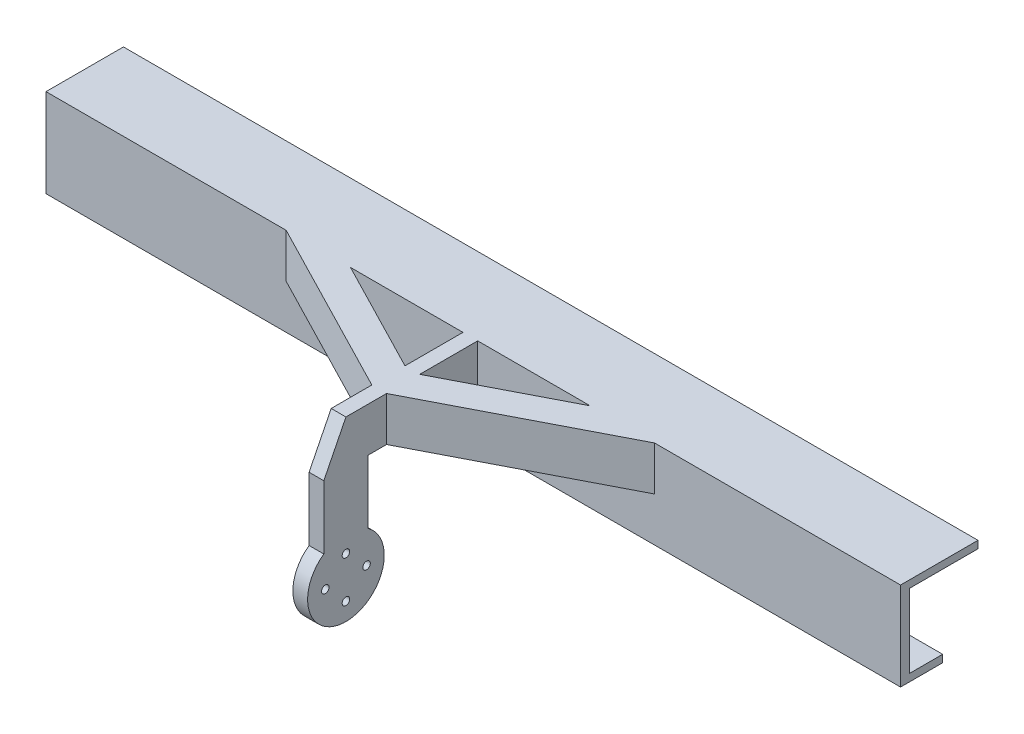
ISO-10303-21;
HEADER;
FILE_DESCRIPTION(('STEP AP214'),'2;1');
FILE_NAME('part.step','',(''),(''),'','','');
FILE_SCHEMA(('AUTOMOTIVE_DESIGN { 1 0 10303 214 1 1 1 1 }'));
ENDSEC;
DATA;
#1=APPLICATION_CONTEXT('core data for automotive mechanical design processes');
#2=APPLICATION_PROTOCOL_DEFINITION('international standard','automotive_design',2000,#1);
#3=PRODUCT_CONTEXT('',#1,'mechanical');
#4=PRODUCT('Part','Part','',(#3));
#5=PRODUCT_RELATED_PRODUCT_CATEGORY('part','',(#4));
#6=PRODUCT_DEFINITION_FORMATION('','',#4);
#7=PRODUCT_DEFINITION_CONTEXT('part definition',#1,'design');
#8=PRODUCT_DEFINITION('design','',#6,#7);
#9=PRODUCT_DEFINITION_SHAPE('','',#8);
#10=(LENGTH_UNIT() NAMED_UNIT(*) SI_UNIT(.MILLI.,.METRE.));
#11=(NAMED_UNIT(*) PLANE_ANGLE_UNIT() SI_UNIT($,.RADIAN.));
#12=(NAMED_UNIT(*) SI_UNIT($,.STERADIAN.) SOLID_ANGLE_UNIT());
#13=UNCERTAINTY_MEASURE_WITH_UNIT(LENGTH_MEASURE(1.E-05),#10,'distance_accuracy_value','');
#14=(GEOMETRIC_REPRESENTATION_CONTEXT(3) GLOBAL_UNCERTAINTY_ASSIGNED_CONTEXT((#13)) GLOBAL_UNIT_ASSIGNED_CONTEXT((#10,
#11,#12)) REPRESENTATION_CONTEXT('',''));
#15=CARTESIAN_POINT('',(0.,0.,0.));
#16=DIRECTION('',(0.,0.,1.));
#17=DIRECTION('',(1.,0.,0.));
#18=AXIS2_PLACEMENT_3D('',#15,#16,#17);
#19=CARTESIAN_POINT('',(1.49999999999955,-32.1500000000001,72.7154567474881));
#20=DIRECTION('',(1.,0.,0.));
#21=DIRECTION('',(0.,1.,0.));
#22=AXIS2_PLACEMENT_3D('',#19,#20,#21);
#23=PLANE('',#22);
#24=DIRECTION('',(0.,1.,0.));
#25=VECTOR('',#24,1.);
#26=CARTESIAN_POINT('',(1.49999999999951,-67.5015997908497,47.671974208502));
#27=LINE('',#26,#25);
#28=CARTESIAN_POINT('',(1.49999999999953,0.,47.671974208502));
#29=VERTEX_POINT('',#28);
#30=CARTESIAN_POINT('',(1.49999999999952,15.,47.671974208502));
#31=VERTEX_POINT('',#30);
#32=EDGE_CURVE('E210',#29,#31,#27,.T.);
#33=ORIENTED_EDGE('',*,*,#32,.F.);
#34=DIRECTION('',(0.,0.,-1.));
#35=VECTOR('',#34,1.);
#36=CARTESIAN_POINT('',(1.49999999999952,0.,27.9954567474881));
#37=LINE('',#36,#35);
#38=CARTESIAN_POINT('',(1.49999999999952,0.,27.9954567474881));
#39=VERTEX_POINT('',#38);
#40=EDGE_CURVE('E284',#29,#39,#37,.T.);
#41=ORIENTED_EDGE('',*,*,#40,.T.);
#42=DIRECTION('',(0.,1.,0.));
#43=VECTOR('',#42,1.);
#44=CARTESIAN_POINT('',(1.49999999999952,0.,27.9954567474881));
#45=LINE('',#44,#43);
#46=CARTESIAN_POINT('',(1.49999999999952,15.,27.9954567474881));
#47=VERTEX_POINT('',#46);
#48=EDGE_CURVE('E287',#39,#47,#45,.T.);
#49=ORIENTED_EDGE('',*,*,#48,.T.);
#50=DIRECTION('',(0.,0.,1.));
#51=VECTOR('',#50,1.);
#52=CARTESIAN_POINT('',(1.49999999999952,15.,27.9954567474881));
#53=LINE('',#52,#51);
#54=EDGE_CURVE('E194',#47,#31,#53,.T.);
#55=ORIENTED_EDGE('',*,*,#54,.T.);
#56=EDGE_LOOP('',(#33,#41,#49,#55));
#57=FACE_BOUND('',#56,.T.);
#58=ADVANCED_FACE('F33',(#57),#23,.T.);
#59=CARTESIAN_POINT('',(-3.50000000000045,-32.1500000000001,72.7154567474881));
#60=DIRECTION('',(1.,0.,0.));
#61=DIRECTION('',(0.,1.,0.));
#62=AXIS2_PLACEMENT_3D('',#59,#60,#61);
#63=PLANE('',#62);
#64=DIRECTION('',(0.,0.,-1.));
#65=VECTOR('',#64,1.);
#66=CARTESIAN_POINT('',(-3.50000000000048,0.,27.9954567474881));
#67=LINE('',#66,#65);
#68=CARTESIAN_POINT('',(-3.50000000000048,0.,47.671974208502));
#69=VERTEX_POINT('',#68);
#70=CARTESIAN_POINT('',(-3.50000000000048,0.,27.9954567474881));
#71=VERTEX_POINT('',#70);
#72=EDGE_CURVE('E303',#69,#71,#67,.T.);
#73=ORIENTED_EDGE('',*,*,#72,.F.);
#74=DIRECTION('',(0.,1.,0.));
#75=VECTOR('',#74,1.);
#76=CARTESIAN_POINT('',(-3.50000000000048,-67.5015997908497,47.671974208502));
#77=LINE('',#76,#75);
#78=CARTESIAN_POINT('',(-3.50000000000048,15.,47.671974208502));
#79=VERTEX_POINT('',#78);
#80=EDGE_CURVE('E242',#69,#79,#77,.T.);
#81=ORIENTED_EDGE('',*,*,#80,.T.);
#82=DIRECTION('',(0.,0.,1.));
#83=VECTOR('',#82,1.);
#84=CARTESIAN_POINT('',(-3.50000000000049,15.,27.9954567474881));
#85=LINE('',#84,#83);
#86=CARTESIAN_POINT('',(-3.50000000000048,14.9999999999999,27.9954567474881));
#87=VERTEX_POINT('',#86);
#88=EDGE_CURVE('E311',#87,#79,#85,.T.);
#89=ORIENTED_EDGE('',*,*,#88,.F.);
#90=DIRECTION('',(0.,1.,0.));
#91=VECTOR('',#90,1.);
#92=CARTESIAN_POINT('',(-3.50000000000048,0.,27.9954567474881));
#93=LINE('',#92,#91);
#94=EDGE_CURVE('E307',#71,#87,#93,.T.);
#95=ORIENTED_EDGE('',*,*,#94,.F.);
#96=EDGE_LOOP('',(#73,#81,#89,#95));
#97=FACE_BOUND('',#96,.T.);
#98=ADVANCED_FACE('F408',(#97),#63,.F.);
#99=CARTESIAN_POINT('',(0.,0.,27.9954567474881));
#100=DIRECTION('',(0.,0.,-1.));
#101=DIRECTION('',(-1.,0.,0.));
#102=AXIS2_PLACEMENT_3D('',#99,#100,#101);
#103=PLANE('',#102);
#104=DIRECTION('',(-1.,0.,0.));
#105=VECTOR('',#104,1.);
#106=CARTESIAN_POINT('',(61.4999999999995,0.,27.9954567474881));
#107=LINE('',#106,#105);
#108=CARTESIAN_POINT('',(61.4999999999995,0.,27.9954567474881));
#109=VERTEX_POINT('',#108);
#110=CARTESIAN_POINT('',(39.6737410562135,0.,27.9954567474881));
#111=VERTEX_POINT('',#110);
#112=EDGE_CURVE('E50',#109,#111,#107,.T.);
#113=ORIENTED_EDGE('',*,*,#112,.T.);
#114=DIRECTION('',(0.,1.,0.));
#115=VECTOR('',#114,1.);
#116=CARTESIAN_POINT('',(39.6737410562135,-67.5015997908497,27.9954567474881));
#117=LINE('',#116,#115);
#118=CARTESIAN_POINT('',(39.6737410562135,15.,27.9954567474881));
#119=VERTEX_POINT('',#118);
#120=EDGE_CURVE('E202',#111,#119,#117,.T.);
#121=ORIENTED_EDGE('',*,*,#120,.T.);
#122=DIRECTION('',(-1.,0.,0.));
#123=VECTOR('',#122,1.);
#124=CARTESIAN_POINT('',(145.,15.,27.9954567474881));
#125=LINE('',#124,#123);
#126=EDGE_CURVE('E189',#119,#47,#125,.T.);
#127=ORIENTED_EDGE('',*,*,#126,.T.);
#128=ORIENTED_EDGE('',*,*,#48,.F.);
#129=DIRECTION('',(1.,0.,0.));
#130=VECTOR('',#129,1.);
#131=CARTESIAN_POINT('',(-3.50000000000048,0.,27.9954567474881));
#132=LINE('',#131,#130);
#133=EDGE_CURVE('E329',#71,#39,#132,.T.);
#134=ORIENTED_EDGE('',*,*,#133,.F.);
#135=ORIENTED_EDGE('',*,*,#94,.T.);
#136=CARTESIAN_POINT('',(-41.6737410562145,14.9999999999999,27.9954567474881));
#137=VERTEX_POINT('',#136);
#138=EDGE_CURVE('E198',#87,#137,#125,.T.);
#139=ORIENTED_EDGE('',*,*,#138,.T.);
#140=DIRECTION('',(0.,1.,0.));
#141=VECTOR('',#140,1.);
#142=CARTESIAN_POINT('',(-41.6737410562145,-67.5015997908497,27.9954567474881));
#143=LINE('',#142,#141);
#144=CARTESIAN_POINT('',(-41.6737410562145,0.,27.9954567474881));
#145=VERTEX_POINT('',#144);
#146=EDGE_CURVE('E234',#145,#137,#143,.T.);
#147=ORIENTED_EDGE('',*,*,#146,.F.);
#148=DIRECTION('',(-1.,0.,0.));
#149=VECTOR('',#148,1.);
#150=CARTESIAN_POINT('',(-63.5000000000005,0.,27.9954567474881));
#151=LINE('',#150,#149);
#152=CARTESIAN_POINT('',(-63.5000000000005,0.,27.9954567474881));
#153=VERTEX_POINT('',#152);
#154=EDGE_CURVE('E239',#145,#153,#151,.T.);
#155=ORIENTED_EDGE('',*,*,#154,.T.);
#156=DIRECTION('',(0.,1.,0.));
#157=VECTOR('',#156,1.);
#158=CARTESIAN_POINT('',(-63.5000000000005,-67.5015997908497,27.9954567474881));
#159=LINE('',#158,#157);
#160=CARTESIAN_POINT('',(-63.5000000000005,15.,27.9954567474881));
#161=VERTEX_POINT('',#160);
#162=EDGE_CURVE('E238',#153,#161,#159,.T.);
#163=ORIENTED_EDGE('',*,*,#162,.T.);
#164=CARTESIAN_POINT('',(-145.,14.9999999999999,27.9954567474881));
#165=VERTEX_POINT('',#164);
#166=EDGE_CURVE('E200',#161,#165,#125,.T.);
#167=ORIENTED_EDGE('',*,*,#166,.T.);
#168=DIRECTION('',(0.,-1.,0.));
#169=VECTOR('',#168,1.);
#170=CARTESIAN_POINT('',(-145.,14.9999999999999,27.9954567474881));
#171=LINE('',#170,#169);
#172=CARTESIAN_POINT('',(-145.,-15.,27.9954567474881));
#173=VERTEX_POINT('',#172);
#174=EDGE_CURVE('E354',#165,#173,#171,.T.);
#175=ORIENTED_EDGE('',*,*,#174,.T.);
#176=DIRECTION('',(1.,0.,0.));
#177=VECTOR('',#176,1.);
#178=CARTESIAN_POINT('',(145.,-15.,27.9954567474881));
#179=LINE('',#178,#177);
#180=CARTESIAN_POINT('',(145.,-15.,27.9954567474881));
#181=VERTEX_POINT('',#180);
#182=EDGE_CURVE('E357',#173,#181,#179,.T.);
#183=ORIENTED_EDGE('',*,*,#182,.T.);
#184=DIRECTION('',(0.,1.,0.));
#185=VECTOR('',#184,1.);
#186=CARTESIAN_POINT('',(145.,15.,27.9954567474881));
#187=LINE('',#186,#185);
#188=CARTESIAN_POINT('',(145.,15.,27.9954567474881));
#189=VERTEX_POINT('',#188);
#190=EDGE_CURVE('E351',#181,#189,#187,.T.);
#191=ORIENTED_EDGE('',*,*,#190,.T.);
#192=CARTESIAN_POINT('',(61.4999999999995,15.,27.9954567474881));
#193=VERTEX_POINT('',#192);
#194=EDGE_CURVE('E197',#189,#193,#125,.T.);
#195=ORIENTED_EDGE('',*,*,#194,.T.);
#196=DIRECTION('',(0.,1.,0.));
#197=VECTOR('',#196,1.);
#198=CARTESIAN_POINT('',(61.4999999999995,-67.5015997908497,27.9954567474881));
#199=LINE('',#198,#197);
#200=EDGE_CURVE('E55',#109,#193,#199,.T.);
#201=ORIENTED_EDGE('',*,*,#200,.F.);
#202=EDGE_LOOP('',(#113,#121,#127,#128,#134,#135,#139,#147,#155,#163,#167,#175,#183,#191,#195,#201));
#203=FACE_BOUND('',#202,.T.);
#204=ADVANCED_FACE('F203',(#203),#103,.F.);
#205=CARTESIAN_POINT('',(0.,0.,1.71545674748813));
#206=DIRECTION('',(0.,0.,-1.));
#207=DIRECTION('',(-1.,0.,0.));
#208=AXIS2_PLACEMENT_3D('',#205,#206,#207);
#209=PLANE('',#208);
#210=DIRECTION('',(-1.,0.,0.));
#211=VECTOR('',#210,1.);
#212=CARTESIAN_POINT('',(140.,12.5,1.71545674748813));
#213=LINE('',#212,#211);
#214=CARTESIAN_POINT('',(145.,12.5,1.71545674748813));
#215=VERTEX_POINT('',#214);
#216=CARTESIAN_POINT('',(-145.,12.5,1.71545674748814));
#217=VERTEX_POINT('',#216);
#218=EDGE_CURVE('E360',#215,#217,#213,.T.);
#219=ORIENTED_EDGE('',*,*,#218,.T.);
#220=DIRECTION('',(0.,-1.,0.));
#221=VECTOR('',#220,1.);
#222=CARTESIAN_POINT('',(-145.,15.,1.71545674748813));
#223=LINE('',#222,#221);
#224=CARTESIAN_POINT('',(-145.,15.,1.71545674748813));
#225=VERTEX_POINT('',#224);
#226=EDGE_CURVE('E371',#225,#217,#223,.T.);
#227=ORIENTED_EDGE('',*,*,#226,.F.);
#228=DIRECTION('',(-1.,0.,0.));
#229=VECTOR('',#228,1.);
#230=CARTESIAN_POINT('',(145.,15.,1.71545674748813));
#231=LINE('',#230,#229);
#232=CARTESIAN_POINT('',(145.,15.,1.71545674748813));
#233=VERTEX_POINT('',#232);
#234=EDGE_CURVE('E369',#233,#225,#231,.T.);
#235=ORIENTED_EDGE('',*,*,#234,.F.);
#236=DIRECTION('',(0.,1.,0.));
#237=VECTOR('',#236,1.);
#238=CARTESIAN_POINT('',(145.,15.,1.71545674748813));
#239=LINE('',#238,#237);
#240=EDGE_CURVE('E366',#215,#233,#239,.T.);
#241=ORIENTED_EDGE('',*,*,#240,.F.);
#242=EDGE_LOOP('',(#219,#227,#235,#241));
#243=FACE_BOUND('',#242,.T.);
#244=ADVANCED_FACE('F493',(#243),#209,.T.);
#245=CARTESIAN_POINT('',(145.,15.,24.9954567474881));
#246=DIRECTION('',(-1.,0.,0.));
#247=DIRECTION('',(0.,0.,1.));
#248=AXIS2_PLACEMENT_3D('',#245,#246,#247);
#249=PLANE('',#248);
#250=DIRECTION('',(0.,0.,-1.));
#251=VECTOR('',#250,1.);
#252=CARTESIAN_POINT('',(145.,-15.,24.9954567474881));
#253=LINE('',#252,#251);
#254=CARTESIAN_POINT('',(145.,-15.,13.7154567474881));
#255=VERTEX_POINT('',#254);
#256=EDGE_CURVE('E374',#181,#255,#253,.T.);
#257=ORIENTED_EDGE('',*,*,#256,.T.);
#258=DIRECTION('',(0.,-1.,0.));
#259=VECTOR('',#258,1.);
#260=CARTESIAN_POINT('',(145.,-15.,13.7154567474881));
#261=LINE('',#260,#259);
#262=CARTESIAN_POINT('',(145.,-12.5000000000035,13.7154567474881));
#263=VERTEX_POINT('',#262);
#264=EDGE_CURVE('E249',#263,#255,#261,.T.);
#265=ORIENTED_EDGE('',*,*,#264,.F.);
#266=DIRECTION('',(0.,0.,1.));
#267=VECTOR('',#266,1.);
#268=CARTESIAN_POINT('',(145.,-12.5,24.9954567474881));
#269=LINE('',#268,#267);
#270=CARTESIAN_POINT('',(145.,-12.5,24.9954567474881));
#271=VERTEX_POINT('',#270);
#272=EDGE_CURVE('E346',#263,#271,#269,.T.);
#273=ORIENTED_EDGE('',*,*,#272,.T.);
#274=DIRECTION('',(0.,1.,0.));
#275=VECTOR('',#274,1.);
#276=CARTESIAN_POINT('',(145.,15.,24.9954567474881));
#277=LINE('',#276,#275);
#278=CARTESIAN_POINT('',(145.,12.5,24.9954567474881));
#279=VERTEX_POINT('',#278);
#280=EDGE_CURVE('E348',#271,#279,#277,.T.);
#281=ORIENTED_EDGE('',*,*,#280,.T.);
#282=DIRECTION('',(0.,0.,-1.));
#283=VECTOR('',#282,1.);
#284=CARTESIAN_POINT('',(145.,12.5,24.9954567474881));
#285=LINE('',#284,#283);
#286=EDGE_CURVE('E343',#279,#215,#285,.T.);
#287=ORIENTED_EDGE('',*,*,#286,.T.);
#288=ORIENTED_EDGE('',*,*,#240,.T.);
#289=DIRECTION('',(0.,0.,-1.));
#290=VECTOR('',#289,1.);
#291=CARTESIAN_POINT('',(145.,15.,24.9954567474881));
#292=LINE('',#291,#290);
#293=EDGE_CURVE('E11',#189,#233,#292,.T.);
#294=ORIENTED_EDGE('',*,*,#293,.F.);
#295=ORIENTED_EDGE('',*,*,#190,.F.);
#296=EDGE_LOOP('',(#257,#265,#273,#281,#287,#288,#294,#295));
#297=FACE_BOUND('',#296,.T.);
#298=ADVANCED_FACE('F35',(#297),#249,.F.);
#299=CARTESIAN_POINT('',(145.,15.,24.9954567474881));
#300=DIRECTION('',(0.,-1.,0.));
#301=DIRECTION('',(0.,0.,-1.));
#302=AXIS2_PLACEMENT_3D('',#299,#300,#301);
#303=PLANE('',#302);
#304=ORIENTED_EDGE('',*,*,#126,.F.);
#305=DIRECTION('',(-0.888867822183578,0.,0.458163720395475));
#306=VECTOR('',#305,1.);
#307=CARTESIAN_POINT('',(1.49999999999951,15.,47.671974208502));
#308=LINE('',#307,#306);
#309=EDGE_CURVE('E193',#119,#31,#308,.T.);
#310=ORIENTED_EDGE('',*,*,#309,.T.);
#311=ORIENTED_EDGE('',*,*,#54,.F.);
#312=EDGE_LOOP('',(#304,#310,#311));
#313=FACE_BOUND('',#312,.T.);
#314=ORIENTED_EDGE('',*,*,#166,.F.);
#315=DIRECTION('',(0.888867822183578,0.,0.458163720395476));
#316=VECTOR('',#315,1.);
#317=CARTESIAN_POINT('',(-3.50000000000048,15.,58.9222408403103));
#318=LINE('',#317,#316);
#319=CARTESIAN_POINT('',(-3.50000000000048,15.,58.9222408403103));
#320=VERTEX_POINT('',#319);
#321=EDGE_CURVE('E226',#161,#320,#318,.T.);
#322=ORIENTED_EDGE('',*,*,#321,.T.);
#323=CARTESIAN_POINT('',(-3.50000000000048,14.9999999999999,72.7154567474882));
#324=VERTEX_POINT('',#323);
#325=EDGE_CURVE('E310',#320,#324,#85,.T.);
#326=ORIENTED_EDGE('',*,*,#325,.T.);
#327=DIRECTION('',(1.,0.,0.));
#328=VECTOR('',#327,1.);
#329=CARTESIAN_POINT('',(-3.50000000000048,14.9999999999999,72.7154567474882));
#330=LINE('',#329,#328);
#331=CARTESIAN_POINT('',(1.49999999999952,14.9999999999999,72.7154567474882));
#332=VERTEX_POINT('',#331);
#333=EDGE_CURVE('E326',#324,#332,#330,.T.);
#334=ORIENTED_EDGE('',*,*,#333,.T.);
#335=CARTESIAN_POINT('',(1.49999999999952,14.9999999999999,58.9222408403103));
#336=VERTEX_POINT('',#335);
#337=EDGE_CURVE('E289',#336,#332,#53,.T.);
#338=ORIENTED_EDGE('',*,*,#337,.F.);
#339=DIRECTION('',(0.888867822183578,0.,-0.458163720395476));
#340=VECTOR('',#339,1.);
#341=CARTESIAN_POINT('',(1.49999999999951,15.,58.9222408403103));
#342=LINE('',#341,#340);
#343=EDGE_CURVE('E211',#336,#193,#342,.T.);
#344=ORIENTED_EDGE('',*,*,#343,.T.);
#345=ORIENTED_EDGE('',*,*,#194,.F.);
#346=ORIENTED_EDGE('',*,*,#293,.T.);
#347=ORIENTED_EDGE('',*,*,#234,.T.);
#348=DIRECTION('',(0.,0.,-1.));
#349=VECTOR('',#348,1.);
#350=CARTESIAN_POINT('',(-145.,15.,24.9954567474881));
#351=LINE('',#350,#349);
#352=EDGE_CURVE('E42',#165,#225,#351,.T.);
#353=ORIENTED_EDGE('',*,*,#352,.F.);
#354=EDGE_LOOP('',(#314,#322,#326,#334,#338,#344,#345,#346,#347,#353));
#355=FACE_BOUND('',#354,.T.);
#356=DIRECTION('',(-0.888867822183578,0.,-0.458163720395475));
#357=VECTOR('',#356,1.);
#358=CARTESIAN_POINT('',(-3.50000000000048,15.,47.671974208502));
#359=LINE('',#358,#357);
#360=EDGE_CURVE('E225',#79,#137,#359,.T.);
#361=ORIENTED_EDGE('',*,*,#360,.T.);
#362=ORIENTED_EDGE('',*,*,#138,.F.);
#363=ORIENTED_EDGE('',*,*,#88,.T.);
#364=EDGE_LOOP('',(#361,#362,#363));
#365=FACE_BOUND('',#364,.T.);
#366=ADVANCED_FACE('F190',(#313,#355,#365),#303,.F.);
#367=CARTESIAN_POINT('',(-145.,15.,24.9954567474881));
#368=DIRECTION('',(1.,0.,0.));
#369=DIRECTION('',(0.,0.,-1.));
#370=AXIS2_PLACEMENT_3D('',#367,#368,#369);
#371=PLANE('',#370);
#372=DIRECTION('',(0.,0.,-1.));
#373=VECTOR('',#372,1.);
#374=CARTESIAN_POINT('',(-145.,-12.4999999999999,1.71545674748814));
#375=LINE('',#374,#373);
#376=CARTESIAN_POINT('',(-145.,-12.5,24.9954567474881));
#377=VERTEX_POINT('',#376);
#378=CARTESIAN_POINT('',(-145.,-12.4999999999999,13.7154567474881));
#379=VERTEX_POINT('',#378);
#380=EDGE_CURVE('E340',#377,#379,#375,.T.);
#381=ORIENTED_EDGE('',*,*,#380,.T.);
#382=DIRECTION('',(0.,1.,0.));
#383=VECTOR('',#382,1.);
#384=CARTESIAN_POINT('',(-145.,-14.9999999999965,13.7154567474881));
#385=LINE('',#384,#383);
#386=CARTESIAN_POINT('',(-145.,-14.9999999999965,13.7154567474881));
#387=VERTEX_POINT('',#386);
#388=EDGE_CURVE('E253',#387,#379,#385,.T.);
#389=ORIENTED_EDGE('',*,*,#388,.F.);
#390=DIRECTION('',(0.,0.,-1.));
#391=VECTOR('',#390,1.);
#392=CARTESIAN_POINT('',(-145.,-15.,24.9954567474881));
#393=LINE('',#392,#391);
#394=EDGE_CURVE('E377',#173,#387,#393,.T.);
#395=ORIENTED_EDGE('',*,*,#394,.F.);
#396=ORIENTED_EDGE('',*,*,#174,.F.);
#397=ORIENTED_EDGE('',*,*,#352,.T.);
#398=ORIENTED_EDGE('',*,*,#226,.T.);
#399=DIRECTION('',(0.,0.,1.));
#400=VECTOR('',#399,1.);
#401=CARTESIAN_POINT('',(-145.,12.5,1.71545674748814));
#402=LINE('',#401,#400);
#403=CARTESIAN_POINT('',(-145.,12.5,24.9954567474881));
#404=VERTEX_POINT('',#403);
#405=EDGE_CURVE('E323',#217,#404,#402,.T.);
#406=ORIENTED_EDGE('',*,*,#405,.T.);
#407=DIRECTION('',(0.,-1.,0.));
#408=VECTOR('',#407,1.);
#409=CARTESIAN_POINT('',(-145.,-12.5,24.9954567474881));
#410=LINE('',#409,#408);
#411=EDGE_CURVE('E337',#404,#377,#410,.T.);
#412=ORIENTED_EDGE('',*,*,#411,.T.);
#413=EDGE_LOOP('',(#381,#389,#395,#396,#397,#398,#406,#412));
#414=FACE_BOUND('',#413,.T.);
#415=ADVANCED_FACE('F497',(#414),#371,.F.);
#416=CARTESIAN_POINT('',(145.,-15.,24.9954567474881));
#417=DIRECTION('',(0.,1.,0.));
#418=DIRECTION('',(0.,0.,1.));
#419=AXIS2_PLACEMENT_3D('',#416,#417,#418);
#420=PLANE('',#419);
#421=ORIENTED_EDGE('',*,*,#394,.T.);
#422=DIRECTION('',(-1.,0.,0.));
#423=VECTOR('',#422,1.);
#424=CARTESIAN_POINT('',(145.,-15.,13.7154567474881));
#425=LINE('',#424,#423);
#426=EDGE_CURVE('E251',#255,#387,#425,.T.);
#427=ORIENTED_EDGE('',*,*,#426,.F.);
#428=ORIENTED_EDGE('',*,*,#256,.F.);
#429=ORIENTED_EDGE('',*,*,#182,.F.);
#430=EDGE_LOOP('',(#421,#427,#428,#429));
#431=FACE_BOUND('',#430,.T.);
#432=ADVANCED_FACE('F500',(#431),#420,.F.);
#433=CARTESIAN_POINT('',(140.,12.5,24.9954567474881));
#434=DIRECTION('',(0.,-1.,0.));
#435=DIRECTION('',(1.,0.,0.));
#436=AXIS2_PLACEMENT_3D('',#433,#434,#435);
#437=PLANE('',#436);
#438=ORIENTED_EDGE('',*,*,#218,.F.);
#439=ORIENTED_EDGE('',*,*,#286,.F.);
#440=DIRECTION('',(-1.,0.,0.));
#441=VECTOR('',#440,1.);
#442=CARTESIAN_POINT('',(140.,12.5,24.9954567474881));
#443=LINE('',#442,#441);
#444=EDGE_CURVE('E361',#279,#404,#443,.T.);
#445=ORIENTED_EDGE('',*,*,#444,.T.);
#446=ORIENTED_EDGE('',*,*,#405,.F.);
#447=EDGE_LOOP('',(#438,#439,#445,#446));
#448=FACE_BOUND('',#447,.T.);
#449=ADVANCED_FACE('F514',(#448),#437,.T.);
#450=CARTESIAN_POINT('',(140.,-12.5,24.9954567474881));
#451=DIRECTION('',(0.,1.,0.));
#452=DIRECTION('',(-1.,0.,0.));
#453=AXIS2_PLACEMENT_3D('',#450,#451,#452);
#454=PLANE('',#453);
#455=DIRECTION('',(1.,0.,0.));
#456=VECTOR('',#455,1.);
#457=CARTESIAN_POINT('',(145.,-12.5000000000035,13.7154567474881));
#458=LINE('',#457,#456);
#459=EDGE_CURVE('E255',#379,#263,#458,.T.);
#460=ORIENTED_EDGE('',*,*,#459,.F.);
#461=ORIENTED_EDGE('',*,*,#380,.F.);
#462=DIRECTION('',(1.,0.,0.));
#463=VECTOR('',#462,1.);
#464=CARTESIAN_POINT('',(140.,-12.5,24.9954567474881));
#465=LINE('',#464,#463);
#466=EDGE_CURVE('E363',#377,#271,#465,.T.);
#467=ORIENTED_EDGE('',*,*,#466,.T.);
#468=ORIENTED_EDGE('',*,*,#272,.F.);
#469=EDGE_LOOP('',(#460,#461,#467,#468));
#470=FACE_BOUND('',#469,.T.);
#471=ADVANCED_FACE('F507',(#470),#454,.T.);
#472=CARTESIAN_POINT('',(0.,0.,24.9954567474881));
#473=DIRECTION('',(0.,0.,-1.));
#474=DIRECTION('',(-1.,0.,0.));
#475=AXIS2_PLACEMENT_3D('',#472,#473,#474);
#476=PLANE('',#475);
#477=ORIENTED_EDGE('',*,*,#444,.F.);
#478=ORIENTED_EDGE('',*,*,#280,.F.);
#479=ORIENTED_EDGE('',*,*,#466,.F.);
#480=ORIENTED_EDGE('',*,*,#411,.F.);
#481=EDGE_LOOP('',(#477,#478,#479,#480));
#482=FACE_BOUND('',#481,.T.);
#483=ADVANCED_FACE('F511',(#482),#476,.T.);
#484=CARTESIAN_POINT('',(-3.50000000000045,-32.1500000000001,72.7154567474881));
#485=DIRECTION('',(1.,0.,0.));
#486=DIRECTION('',(0.,1.,0.));
#487=AXIS2_PLACEMENT_3D('',#484,#485,#486);
#488=CYLINDRICAL_SURFACE('',#487,13.);
#489=DIRECTION('',(1.,0.,0.));
#490=VECTOR('',#489,1.);
#491=CARTESIAN_POINT('',(-3.50000000000046,-21.5316197092025,65.2154567474881));
#492=LINE('',#491,#490);
#493=CARTESIAN_POINT('',(-3.50000000000046,-21.5316197092025,65.2154567474881));
#494=VERTEX_POINT('',#493);
#495=CARTESIAN_POINT('',(1.49999999999954,-21.5316197092025,65.2154567474881));
#496=VERTEX_POINT('',#495);
#497=EDGE_CURVE('E320',#494,#496,#492,.T.);
#498=ORIENTED_EDGE('',*,*,#497,.T.);
#499=CARTESIAN_POINT('',(1.49999999999955,-32.1500000000001,72.7154567474881));
#500=DIRECTION('',(1.,0.,0.));
#501=DIRECTION('',(0.,1.,0.));
#502=AXIS2_PLACEMENT_3D('',#499,#500,#501);
#503=CIRCLE('',#502,13.);
#504=CARTESIAN_POINT('',(1.49999999999954,-21.5316197092025,80.2154567474881));
#505=VERTEX_POINT('',#504);
#506=EDGE_CURVE('E276',#505,#496,#503,.T.);
#507=ORIENTED_EDGE('',*,*,#506,.F.);
#508=DIRECTION('',(1.,0.,0.));
#509=VECTOR('',#508,1.);
#510=CARTESIAN_POINT('',(-3.50000000000046,-21.5316197092025,80.2154567474881));
#511=LINE('',#510,#509);
#512=CARTESIAN_POINT('',(-3.50000000000046,-21.5316197092025,80.2154567474881));
#513=VERTEX_POINT('',#512);
#514=EDGE_CURVE('E321',#513,#505,#511,.T.);
#515=ORIENTED_EDGE('',*,*,#514,.F.);
#516=CARTESIAN_POINT('',(-3.50000000000045,-32.1500000000001,72.7154567474881));
#517=DIRECTION('',(1.,0.,0.));
#518=DIRECTION('',(0.,1.,0.));
#519=AXIS2_PLACEMENT_3D('',#516,#517,#518);
#520=CIRCLE('',#519,13.);
#521=EDGE_CURVE('E297',#513,#494,#520,.T.);
#522=ORIENTED_EDGE('',*,*,#521,.T.);
#523=EDGE_LOOP('',(#498,#507,#515,#522));
#524=FACE_BOUND('',#523,.T.);
#525=ADVANCED_FACE('F472',(#524),#488,.T.);
#526=CARTESIAN_POINT('',(-3.50000000000047,-1.31716720107613E-13,80.2154567474881));
#527=DIRECTION('',(0.,0.,1.));
#528=DIRECTION('',(1.,0.,0.));
#529=AXIS2_PLACEMENT_3D('',#526,#527,#528);
#530=PLANE('',#529);
#531=ORIENTED_EDGE('',*,*,#514,.T.);
#532=DIRECTION('',(0.,-1.,0.));
#533=VECTOR('',#532,1.);
#534=CARTESIAN_POINT('',(1.49999999999953,-1.2863636621031E-13,80.2154567474881));
#535=LINE('',#534,#533);
#536=CARTESIAN_POINT('',(1.49999999999953,-1.2863636621031E-13,80.2154567474881));
#537=VERTEX_POINT('',#536);
#538=EDGE_CURVE('E294',#537,#505,#535,.T.);
#539=ORIENTED_EDGE('',*,*,#538,.F.);
#540=DIRECTION('',(1.,0.,0.));
#541=VECTOR('',#540,1.);
#542=CARTESIAN_POINT('',(-3.50000000000047,-1.31716720107613E-13,80.2154567474881));
#543=LINE('',#542,#541);
#544=CARTESIAN_POINT('',(-3.50000000000047,-1.31716720107613E-13,80.2154567474881));
#545=VERTEX_POINT('',#544);
#546=EDGE_CURVE('E324',#545,#537,#543,.T.);
#547=ORIENTED_EDGE('',*,*,#546,.F.);
#548=DIRECTION('',(0.,-1.,0.));
#549=VECTOR('',#548,1.);
#550=CARTESIAN_POINT('',(-3.50000000000047,-1.31716720107613E-13,80.2154567474881));
#551=LINE('',#550,#549);
#552=EDGE_CURVE('E317',#545,#513,#551,.T.);
#553=ORIENTED_EDGE('',*,*,#552,.T.);
#554=EDGE_LOOP('',(#531,#539,#547,#553));
#555=FACE_BOUND('',#554,.T.);
#556=ADVANCED_FACE('F469',(#555),#530,.T.);
#557=CARTESIAN_POINT('',(-3.50000000000047,-1.31716720107613E-13,80.2154567474881));
#558=DIRECTION('',(0.,0.447213595499957,0.894427190999916));
#559=DIRECTION('',(0.,-0.894427190999916,0.447213595499957));
#560=AXIS2_PLACEMENT_3D('',#557,#558,#559);
#561=PLANE('',#560);
#562=ORIENTED_EDGE('',*,*,#546,.T.);
#563=DIRECTION('',(0.,-0.894427190999916,0.447213595499957));
#564=VECTOR('',#563,1.);
#565=CARTESIAN_POINT('',(1.49999999999953,-1.2863636621031E-13,80.2154567474881));
#566=LINE('',#565,#564);
#567=EDGE_CURVE('E291',#332,#537,#566,.T.);
#568=ORIENTED_EDGE('',*,*,#567,.F.);
#569=ORIENTED_EDGE('',*,*,#333,.F.);
#570=DIRECTION('',(0.,-0.894427190999916,0.447213595499957));
#571=VECTOR('',#570,1.);
#572=CARTESIAN_POINT('',(-3.50000000000047,-1.31716720107613E-13,80.2154567474881));
#573=LINE('',#572,#571);
#574=EDGE_CURVE('E314',#324,#545,#573,.T.);
#575=ORIENTED_EDGE('',*,*,#574,.T.);
#576=EDGE_LOOP('',(#562,#568,#569,#575));
#577=FACE_BOUND('',#576,.T.);
#578=ADVANCED_FACE('F465',(#577),#561,.T.);
#579=CARTESIAN_POINT('',(-3.50000000000048,0.,27.9954567474881));
#580=DIRECTION('',(0.,-1.,0.));
#581=DIRECTION('',(0.,0.,-1.));
#582=AXIS2_PLACEMENT_3D('',#579,#580,#581);
#583=PLANE('',#582);
#584=ORIENTED_EDGE('',*,*,#133,.T.);
#585=ORIENTED_EDGE('',*,*,#40,.F.);
#586=DIRECTION('',(-0.888867822183578,0.,0.458163720395476));
#587=VECTOR('',#586,1.);
#588=CARTESIAN_POINT('',(1.49999999999936,0.,47.6719742085021));
#589=LINE('',#588,#587);
#590=EDGE_CURVE('E206',#111,#29,#589,.T.);
#591=ORIENTED_EDGE('',*,*,#590,.F.);
#592=ORIENTED_EDGE('',*,*,#112,.F.);
#593=DIRECTION('',(0.888867822183578,0.,-0.458163720395476));
#594=VECTOR('',#593,1.);
#595=CARTESIAN_POINT('',(1.49999999999936,-1.11022302462516E-13,58.9222408403104));
#596=LINE('',#595,#594);
#597=CARTESIAN_POINT('',(1.49999999999951,-1.11022302462514E-13,58.9222408403103));
#598=VERTEX_POINT('',#597);
#599=EDGE_CURVE('E217',#598,#109,#596,.T.);
#600=ORIENTED_EDGE('',*,*,#599,.F.);
#601=CARTESIAN_POINT('',(1.49999999999953,-1.26799396011589E-13,65.2154567474881));
#602=VERTEX_POINT('',#601);
#603=EDGE_CURVE('E285',#602,#598,#37,.T.);
#604=ORIENTED_EDGE('',*,*,#603,.F.);
#605=DIRECTION('',(1.,0.,0.));
#606=VECTOR('',#605,1.);
#607=CARTESIAN_POINT('',(-3.50000000000047,-1.29879749908892E-13,65.2154567474881));
#608=LINE('',#607,#606);
#609=CARTESIAN_POINT('',(-3.50000000000047,-1.29879749908892E-13,65.2154567474881));
#610=VERTEX_POINT('',#609);
#611=EDGE_CURVE('E332',#610,#602,#608,.T.);
#612=ORIENTED_EDGE('',*,*,#611,.F.);
#613=CARTESIAN_POINT('',(-3.50000000000047,-1.02124460979307E-13,58.9222408403103));
#614=VERTEX_POINT('',#613);
#615=EDGE_CURVE('E304',#610,#614,#67,.T.);
#616=ORIENTED_EDGE('',*,*,#615,.T.);
#617=DIRECTION('',(0.888867822183578,0.,0.458163720395476));
#618=VECTOR('',#617,1.);
#619=CARTESIAN_POINT('',(-3.50000000000039,-1.11022302462516E-13,58.9222408403103));
#620=LINE('',#619,#618);
#621=EDGE_CURVE('E235',#153,#614,#620,.T.);
#622=ORIENTED_EDGE('',*,*,#621,.F.);
#623=ORIENTED_EDGE('',*,*,#154,.F.);
#624=DIRECTION('',(-0.888867822183578,0.,-0.458163720395476));
#625=VECTOR('',#624,1.);
#626=CARTESIAN_POINT('',(-3.50000000000039,0.,47.671974208502));
#627=LINE('',#626,#625);
#628=EDGE_CURVE('E229',#69,#145,#627,.T.);
#629=ORIENTED_EDGE('',*,*,#628,.F.);
#630=ORIENTED_EDGE('',*,*,#72,.T.);
#631=EDGE_LOOP('',(#584,#585,#591,#592,#600,#604,#612,#616,#622,#623,#629,#630));
#632=FACE_BOUND('',#631,.T.);
#633=ADVANCED_FACE('F479',(#632),#583,.T.);
#634=CARTESIAN_POINT('',(-3.50000000000047,-1.29879749908892E-13,65.2154567474881));
#635=DIRECTION('',(0.,0.,-1.));
#636=DIRECTION('',(-1.,0.,0.));
#637=AXIS2_PLACEMENT_3D('',#634,#635,#636);
#638=PLANE('',#637);
#639=ORIENTED_EDGE('',*,*,#611,.T.);
#640=DIRECTION('',(0.,1.,0.));
#641=VECTOR('',#640,1.);
#642=CARTESIAN_POINT('',(1.49999999999953,-1.26799396011589E-13,65.2154567474881));
#643=LINE('',#642,#641);
#644=EDGE_CURVE('E281',#496,#602,#643,.T.);
#645=ORIENTED_EDGE('',*,*,#644,.F.);
#646=ORIENTED_EDGE('',*,*,#497,.F.);
#647=DIRECTION('',(0.,1.,0.));
#648=VECTOR('',#647,1.);
#649=CARTESIAN_POINT('',(-3.50000000000047,-1.29879749908892E-13,65.2154567474881));
#650=LINE('',#649,#648);
#651=EDGE_CURVE('E300',#494,#610,#650,.T.);
#652=ORIENTED_EDGE('',*,*,#651,.T.);
#653=EDGE_LOOP('',(#639,#645,#646,#652));
#654=FACE_BOUND('',#653,.T.);
#655=ADVANCED_FACE('F429',(#654),#638,.T.);
#656=CARTESIAN_POINT('',(-3.50000000000045,-32.1500000000001,72.7154567474881));
#657=DIRECTION('',(1.,0.,0.));
#658=DIRECTION('',(0.,1.,0.));
#659=AXIS2_PLACEMENT_3D('',#656,#657,#658);
#660=CIRCLE('',#659,9.99999999999999);
#661=CARTESIAN_POINT('',(-3.50000000000046,-22.1500000000001,72.7154567474881));
#662=VERTEX_POINT('',#661);
#663=EDGE_CURVE('E272',#662,#662,#660,.T.);
#664=ORIENTED_EDGE('',*,*,#663,.T.);
#665=EDGE_LOOP('',(#664));
#666=FACE_BOUND('',#665,.T.);
#667=ORIENTED_EDGE('',*,*,#325,.F.);
#668=DIRECTION('',(0.,1.,0.));
#669=VECTOR('',#668,1.);
#670=CARTESIAN_POINT('',(-3.50000000000048,-67.5015997908497,58.9222408403103));
#671=LINE('',#670,#669);
#672=EDGE_CURVE('E237',#614,#320,#671,.T.);
#673=ORIENTED_EDGE('',*,*,#672,.F.);
#674=ORIENTED_EDGE('',*,*,#615,.F.);
#675=ORIENTED_EDGE('',*,*,#651,.F.);
#676=ORIENTED_EDGE('',*,*,#521,.F.);
#677=ORIENTED_EDGE('',*,*,#552,.F.);
#678=ORIENTED_EDGE('',*,*,#574,.F.);
#679=EDGE_LOOP('',(#667,#673,#674,#675,#676,#677,#678));
#680=FACE_BOUND('',#679,.T.);
#681=ADVANCED_FACE('F418',(#666,#680),#63,.F.);
#682=DIRECTION('',(0.,1.,0.));
#683=VECTOR('',#682,1.);
#684=CARTESIAN_POINT('',(1.49999999999951,-67.5015997908497,58.9222408403103));
#685=LINE('',#684,#683);
#686=EDGE_CURVE('E220',#598,#336,#685,.T.);
#687=ORIENTED_EDGE('',*,*,#686,.T.);
#688=ORIENTED_EDGE('',*,*,#337,.T.);
#689=ORIENTED_EDGE('',*,*,#567,.T.);
#690=ORIENTED_EDGE('',*,*,#538,.T.);
#691=ORIENTED_EDGE('',*,*,#506,.T.);
#692=ORIENTED_EDGE('',*,*,#644,.T.);
#693=ORIENTED_EDGE('',*,*,#603,.T.);
#694=EDGE_LOOP('',(#687,#688,#689,#690,#691,#692,#693));
#695=FACE_BOUND('',#694,.T.);
#696=CARTESIAN_POINT('',(1.49999999999954,-25.1500000000001,72.7154567474881));
#697=DIRECTION('',(1.,0.,0.));
#698=DIRECTION('',(0.,1.,0.));
#699=AXIS2_PLACEMENT_3D('',#696,#697,#698);
#700=CIRCLE('',#699,1.275);
#701=CARTESIAN_POINT('',(1.49999999999954,-23.8750000000001,72.7154567474881));
#702=VERTEX_POINT('',#701);
#703=EDGE_CURVE('E269',#702,#702,#700,.T.);
#704=ORIENTED_EDGE('',*,*,#703,.F.);
#705=EDGE_LOOP('',(#704));
#706=FACE_BOUND('',#705,.T.);
#707=CARTESIAN_POINT('',(1.49999999999955,-32.1500000000001,79.7154567474881));
#708=DIRECTION('',(1.,0.,0.));
#709=DIRECTION('',(0.,1.,0.));
#710=AXIS2_PLACEMENT_3D('',#707,#708,#709);
#711=CIRCLE('',#710,1.27499999999998);
#712=CARTESIAN_POINT('',(1.49999999999955,-30.8750000000001,79.7154567474881));
#713=VERTEX_POINT('',#712);
#714=EDGE_CURVE('E266',#713,#713,#711,.T.);
#715=ORIENTED_EDGE('',*,*,#714,.F.);
#716=EDGE_LOOP('',(#715));
#717=FACE_BOUND('',#716,.T.);
#718=CARTESIAN_POINT('',(1.49999999999955,-39.1500000000001,72.7154567474881));
#719=DIRECTION('',(1.,0.,0.));
#720=DIRECTION('',(0.,1.,0.));
#721=AXIS2_PLACEMENT_3D('',#718,#719,#720);
#722=CIRCLE('',#721,1.275);
#723=CARTESIAN_POINT('',(1.49999999999955,-37.8750000000001,72.7154567474881));
#724=VERTEX_POINT('',#723);
#725=EDGE_CURVE('E262',#724,#724,#722,.T.);
#726=ORIENTED_EDGE('',*,*,#725,.F.);
#727=EDGE_LOOP('',(#726));
#728=FACE_BOUND('',#727,.T.);
#729=CARTESIAN_POINT('',(1.49999999999955,-32.1500000000001,65.7154567474881));
#730=DIRECTION('',(1.,0.,0.));
#731=DIRECTION('',(0.,1.,0.));
#732=AXIS2_PLACEMENT_3D('',#729,#730,#731);
#733=CIRCLE('',#732,1.275);
#734=CARTESIAN_POINT('',(1.49999999999955,-30.8750000000001,65.7154567474881));
#735=VERTEX_POINT('',#734);
#736=EDGE_CURVE('E258',#735,#735,#733,.T.);
#737=ORIENTED_EDGE('',*,*,#736,.F.);
#738=EDGE_LOOP('',(#737));
#739=FACE_BOUND('',#738,.T.);
#740=ADVANCED_FACE('F411',(#695,#706,#717,#728,#739),#23,.T.);
#741=CARTESIAN_POINT('',(-1.50000000000045,-32.1500000000001,72.7154567474881));
#742=DIRECTION('',(-1.,0.,0.));
#743=DIRECTION('',(0.,-1.,0.));
#744=AXIS2_PLACEMENT_3D('',#741,#742,#743);
#745=CYLINDRICAL_SURFACE('',#744,9.99999999999999);
#746=CARTESIAN_POINT('',(-1.50000000000045,-32.1500000000001,72.7154567474881));
#747=DIRECTION('',(1.,0.,0.));
#748=DIRECTION('',(0.,1.,0.));
#749=AXIS2_PLACEMENT_3D('',#746,#747,#748);
#750=CIRCLE('',#749,9.99999999999999);
#751=CARTESIAN_POINT('',(-1.50000000000046,-22.1500000000001,72.7154567474881));
#752=VERTEX_POINT('',#751);
#753=EDGE_CURVE('E273',#752,#752,#750,.T.);
#754=ORIENTED_EDGE('',*,*,#753,.T.);
#755=EDGE_LOOP('',(#754));
#756=FACE_BOUND('',#755,.T.);
#757=ORIENTED_EDGE('',*,*,#663,.F.);
#758=EDGE_LOOP('',(#757));
#759=FACE_BOUND('',#758,.T.);
#760=ADVANCED_FACE('F421',(#756,#759),#745,.F.);
#761=CARTESIAN_POINT('',(-1.50000000000045,-32.1500000000001,72.7154567474881));
#762=DIRECTION('',(1.,0.,0.));
#763=DIRECTION('',(0.,1.,0.));
#764=AXIS2_PLACEMENT_3D('',#761,#762,#763);
#765=PLANE('',#764);
#766=CARTESIAN_POINT('',(-1.50000000000046,-25.1500000000001,72.7154567474881));
#767=DIRECTION('',(1.,0.,0.));
#768=DIRECTION('',(0.,1.,0.));
#769=AXIS2_PLACEMENT_3D('',#766,#767,#768);
#770=CIRCLE('',#769,1.275);
#771=CARTESIAN_POINT('',(-1.50000000000046,-23.8750000000001,72.7154567474881));
#772=VERTEX_POINT('',#771);
#773=EDGE_CURVE('E37',#772,#772,#770,.T.);
#774=ORIENTED_EDGE('',*,*,#773,.T.);
#775=EDGE_LOOP('',(#774));
#776=FACE_BOUND('',#775,.T.);
#777=CARTESIAN_POINT('',(-1.50000000000045,-32.1500000000001,79.7154567474881));
#778=DIRECTION('',(1.,0.,0.));
#779=DIRECTION('',(0.,1.,0.));
#780=AXIS2_PLACEMENT_3D('',#777,#778,#779);
#781=CIRCLE('',#780,1.27499999999998);
#782=CARTESIAN_POINT('',(-1.50000000000045,-30.8750000000001,79.7154567474881));
#783=VERTEX_POINT('',#782);
#784=EDGE_CURVE('E265',#783,#783,#781,.T.);
#785=ORIENTED_EDGE('',*,*,#784,.T.);
#786=EDGE_LOOP('',(#785));
#787=FACE_BOUND('',#786,.T.);
#788=CARTESIAN_POINT('',(-1.50000000000045,-39.1500000000001,72.7154567474881));
#789=DIRECTION('',(1.,0.,0.));
#790=DIRECTION('',(0.,1.,0.));
#791=AXIS2_PLACEMENT_3D('',#788,#789,#790);
#792=CIRCLE('',#791,1.275);
#793=CARTESIAN_POINT('',(-1.50000000000045,-37.8750000000001,72.7154567474881));
#794=VERTEX_POINT('',#793);
#795=EDGE_CURVE('E261',#794,#794,#792,.T.);
#796=ORIENTED_EDGE('',*,*,#795,.T.);
#797=EDGE_LOOP('',(#796));
#798=FACE_BOUND('',#797,.T.);
#799=CARTESIAN_POINT('',(-1.50000000000045,-32.1500000000001,65.7154567474881));
#800=DIRECTION('',(1.,0.,0.));
#801=DIRECTION('',(0.,1.,0.));
#802=AXIS2_PLACEMENT_3D('',#799,#800,#801);
#803=CIRCLE('',#802,1.275);
#804=CARTESIAN_POINT('',(-1.50000000000045,-30.8750000000001,65.7154567474881));
#805=VERTEX_POINT('',#804);
#806=EDGE_CURVE('E257',#805,#805,#803,.T.);
#807=ORIENTED_EDGE('',*,*,#806,.T.);
#808=EDGE_LOOP('',(#807));
#809=FACE_BOUND('',#808,.T.);
#810=ORIENTED_EDGE('',*,*,#753,.F.);
#811=EDGE_LOOP('',(#810));
#812=FACE_BOUND('',#811,.T.);
#813=ADVANCED_FACE('F388',(#776,#787,#798,#809,#812),#765,.F.);
#814=CARTESIAN_POINT('',(6.49999999999955,-32.1500000000001,65.7154567474881));
#815=DIRECTION('',(-1.,0.,0.));
#816=DIRECTION('',(0.,-1.,0.));
#817=AXIS2_PLACEMENT_3D('',#814,#815,#816);
#818=CYLINDRICAL_SURFACE('',#817,1.275);
#819=ORIENTED_EDGE('',*,*,#736,.T.);
#820=EDGE_LOOP('',(#819));
#821=FACE_BOUND('',#820,.T.);
#822=ORIENTED_EDGE('',*,*,#806,.F.);
#823=EDGE_LOOP('',(#822));
#824=FACE_BOUND('',#823,.T.);
#825=ADVANCED_FACE('F404',(#821,#824),#818,.F.);
#826=CARTESIAN_POINT('',(6.49999999999955,-39.1500000000001,72.7154567474881));
#827=DIRECTION('',(-1.,0.,0.));
#828=DIRECTION('',(0.,-1.,0.));
#829=AXIS2_PLACEMENT_3D('',#826,#827,#828);
#830=CYLINDRICAL_SURFACE('',#829,1.275);
#831=ORIENTED_EDGE('',*,*,#725,.T.);
#832=EDGE_LOOP('',(#831));
#833=FACE_BOUND('',#832,.T.);
#834=ORIENTED_EDGE('',*,*,#795,.F.);
#835=EDGE_LOOP('',(#834));
#836=FACE_BOUND('',#835,.T.);
#837=ADVANCED_FACE('F394',(#833,#836),#830,.F.);
#838=CARTESIAN_POINT('',(6.49999999999955,-32.1500000000001,79.7154567474881));
#839=DIRECTION('',(-1.,0.,0.));
#840=DIRECTION('',(0.,-1.,0.));
#841=AXIS2_PLACEMENT_3D('',#838,#839,#840);
#842=CYLINDRICAL_SURFACE('',#841,1.27499999999998);
#843=ORIENTED_EDGE('',*,*,#714,.T.);
#844=EDGE_LOOP('',(#843));
#845=FACE_BOUND('',#844,.T.);
#846=ORIENTED_EDGE('',*,*,#784,.F.);
#847=EDGE_LOOP('',(#846));
#848=FACE_BOUND('',#847,.T.);
#849=ADVANCED_FACE('F391',(#845,#848),#842,.F.);
#850=CARTESIAN_POINT('',(6.49999999999954,-25.1500000000001,72.7154567474881));
#851=DIRECTION('',(-1.,0.,0.));
#852=DIRECTION('',(0.,-1.,0.));
#853=AXIS2_PLACEMENT_3D('',#850,#851,#852);
#854=CYLINDRICAL_SURFACE('',#853,1.275);
#855=ORIENTED_EDGE('',*,*,#703,.T.);
#856=EDGE_LOOP('',(#855));
#857=FACE_BOUND('',#856,.T.);
#858=ORIENTED_EDGE('',*,*,#773,.F.);
#859=EDGE_LOOP('',(#858));
#860=FACE_BOUND('',#859,.T.);
#861=ADVANCED_FACE('F393',(#857,#860),#854,.F.);
#862=CARTESIAN_POINT('',(0.,0.,13.7154567474881));
#863=DIRECTION('',(0.,0.,1.));
#864=DIRECTION('',(1.,0.,0.));
#865=AXIS2_PLACEMENT_3D('',#862,#863,#864);
#866=PLANE('',#865);
#867=ORIENTED_EDGE('',*,*,#264,.T.);
#868=ORIENTED_EDGE('',*,*,#426,.T.);
#869=ORIENTED_EDGE('',*,*,#388,.T.);
#870=ORIENTED_EDGE('',*,*,#459,.T.);
#871=EDGE_LOOP('',(#867,#868,#869,#870));
#872=FACE_BOUND('',#871,.T.);
#873=ADVANCED_FACE('F401',(#872),#866,.F.);
#874=CARTESIAN_POINT('',(-3.50000000000048,-67.5015997908497,47.671974208502));
#875=DIRECTION('',(0.458163720395475,0.,-0.888867822183578));
#876=DIRECTION('',(-0.888867822183578,0.,-0.458163720395476));
#877=AXIS2_PLACEMENT_3D('',#874,#875,#876);
#878=PLANE('',#877);
#879=ORIENTED_EDGE('',*,*,#80,.F.);
#880=ORIENTED_EDGE('',*,*,#628,.T.);
#881=ORIENTED_EDGE('',*,*,#146,.T.);
#882=ORIENTED_EDGE('',*,*,#360,.F.);
#883=EDGE_LOOP('',(#879,#880,#881,#882));
#884=FACE_BOUND('',#883,.T.);
#885=ADVANCED_FACE('F567',(#884),#878,.T.);
#886=CARTESIAN_POINT('',(-3.50000000000048,-67.5015997908497,58.9222408403103));
#887=DIRECTION('',(-0.458163720395476,0.,0.888867822183578));
#888=DIRECTION('',(0.888867822183578,0.,0.458163720395476));
#889=AXIS2_PLACEMENT_3D('',#886,#887,#888);
#890=PLANE('',#889);
#891=ORIENTED_EDGE('',*,*,#162,.F.);
#892=ORIENTED_EDGE('',*,*,#621,.T.);
#893=ORIENTED_EDGE('',*,*,#672,.T.);
#894=ORIENTED_EDGE('',*,*,#321,.F.);
#895=EDGE_LOOP('',(#891,#892,#893,#894));
#896=FACE_BOUND('',#895,.T.);
#897=ADVANCED_FACE('F615',(#896),#890,.T.);
#898=CARTESIAN_POINT('',(1.49999999999951,-67.5015997908497,47.671974208502));
#899=DIRECTION('',(-0.458163720395475,0.,-0.888867822183578));
#900=DIRECTION('',(-0.888867822183578,0.,0.458163720395476));
#901=AXIS2_PLACEMENT_3D('',#898,#899,#900);
#902=PLANE('',#901);
#903=ORIENTED_EDGE('',*,*,#120,.F.);
#904=ORIENTED_EDGE('',*,*,#590,.T.);
#905=ORIENTED_EDGE('',*,*,#32,.T.);
#906=ORIENTED_EDGE('',*,*,#309,.F.);
#907=EDGE_LOOP('',(#903,#904,#905,#906));
#908=FACE_BOUND('',#907,.T.);
#909=ADVANCED_FACE('F209',(#908),#902,.T.);
#910=CARTESIAN_POINT('',(1.49999999999951,-67.5015997908497,58.9222408403103));
#911=DIRECTION('',(0.458163720395476,0.,0.888867822183578));
#912=DIRECTION('',(0.888867822183578,0.,-0.458163720395476));
#913=AXIS2_PLACEMENT_3D('',#910,#911,#912);
#914=PLANE('',#913);
#915=ORIENTED_EDGE('',*,*,#686,.F.);
#916=ORIENTED_EDGE('',*,*,#599,.T.);
#917=ORIENTED_EDGE('',*,*,#200,.T.);
#918=ORIENTED_EDGE('',*,*,#343,.F.);
#919=EDGE_LOOP('',(#915,#916,#917,#918));
#920=FACE_BOUND('',#919,.T.);
#921=ADVANCED_FACE('F482',(#920),#914,.T.);
#922=CLOSED_SHELL('',(#58,#98,#204,#244,#298,#366,#415,#432,#449,#471,#483,#525,#556,#578,#633,
#655,#681,#740,#760,#813,#825,#837,#849,#861,#873,#885,#897,#909,#921));
#923=MANIFOLD_SOLID_BREP('B2',#922);
#924=ADVANCED_BREP_SHAPE_REPRESENTATION('',(#18,#923),#14);
#925=SHAPE_DEFINITION_REPRESENTATION(#9,#924);
ENDSEC;
END-ISO-10303-21;
